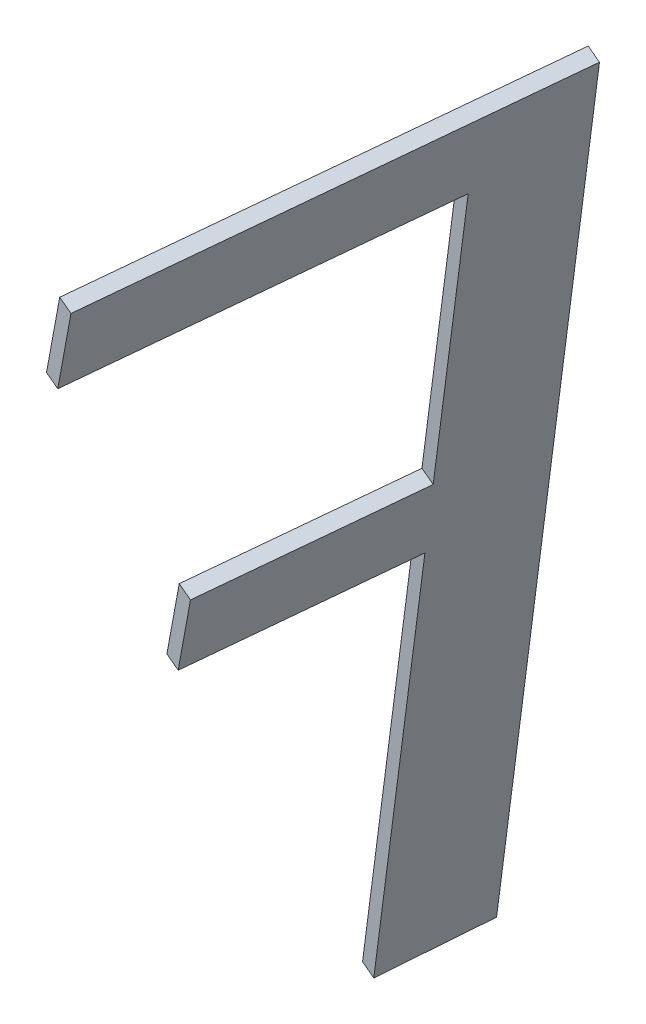
ISO-10303-21;
HEADER;
FILE_DESCRIPTION(('STEP AP214'),'2;1');
FILE_NAME('part.step','',(''),(''),'','','');
FILE_SCHEMA(('AUTOMOTIVE_DESIGN { 1 0 10303 214 1 1 1 1 }'));
ENDSEC;
DATA;
#1=APPLICATION_CONTEXT('core data for automotive mechanical design processes');
#2=APPLICATION_PROTOCOL_DEFINITION('international standard','automotive_design',2000,#1);
#3=PRODUCT_CONTEXT('',#1,'mechanical');
#4=PRODUCT('Part','Part','',(#3));
#5=PRODUCT_RELATED_PRODUCT_CATEGORY('part','',(#4));
#6=PRODUCT_DEFINITION_FORMATION('','',#4);
#7=PRODUCT_DEFINITION_CONTEXT('part definition',#1,'design');
#8=PRODUCT_DEFINITION('design','',#6,#7);
#9=PRODUCT_DEFINITION_SHAPE('','',#8);
#10=(LENGTH_UNIT() NAMED_UNIT(*) SI_UNIT(.MILLI.,.METRE.));
#11=(NAMED_UNIT(*) PLANE_ANGLE_UNIT() SI_UNIT($,.RADIAN.));
#12=(NAMED_UNIT(*) SI_UNIT($,.STERADIAN.) SOLID_ANGLE_UNIT());
#13=UNCERTAINTY_MEASURE_WITH_UNIT(LENGTH_MEASURE(1.E-05),#10,'distance_accuracy_value','');
#14=(GEOMETRIC_REPRESENTATION_CONTEXT(3) GLOBAL_UNCERTAINTY_ASSIGNED_CONTEXT((#13)) GLOBAL_UNIT_ASSIGNED_CONTEXT((#10,
#11,#12)) REPRESENTATION_CONTEXT('',''));
#15=CARTESIAN_POINT('',(0.,0.,0.));
#16=DIRECTION('',(0.,0.,1.));
#17=DIRECTION('',(1.,0.,0.));
#18=AXIS2_PLACEMENT_3D('',#15,#16,#17);
#19=CARTESIAN_POINT('',(-140.081640362419,70.8212531387168,-139.703121267925));
#20=DIRECTION('',(0.251094526540656,0.16569123548096,-0.953676021102616));
#21=DIRECTION('',(0.332083365652077,0.91069878724547,0.245659026227043));
#22=AXIS2_PLACEMENT_3D('',#19,#20,#21);
#23=PLANE('',#22);
#24=DIRECTION('',(-0.909215143405846,0.378383579710355,-0.173648177666983));
#25=VECTOR('',#24,1.);
#26=CARTESIAN_POINT('',(-140.09527858957,70.8269288924125,-139.70572599059));
#27=LINE('',#26,#25);
#28=CARTESIAN_POINT('',(-140.081640362419,70.8212531387168,-139.703121267925));
#29=VERTEX_POINT('',#28);
#30=CARTESIAN_POINT('',(-140.108916816721,70.8326046461081,-139.708330713255));
#31=VERTEX_POINT('',#30);
#32=EDGE_CURVE('E35',#29,#31,#27,.T.);
#33=ORIENTED_EDGE('',*,*,#32,.F.);
#34=DIRECTION('',(-0.332083365652076,-0.91069878724547,-0.245659026227044));
#35=VECTOR('',#34,1.);
#36=CARTESIAN_POINT('',(-140.469601094695,69.7573173776346,-139.990115636066));
#37=LINE('',#36,#35);
#38=CARTESIAN_POINT('',(-140.857561826966,68.6933816165606,-140.277110004211));
#39=VERTEX_POINT('',#38);
#40=EDGE_CURVE('E11',#29,#39,#37,.T.);
#41=ORIENTED_EDGE('',*,*,#40,.T.);
#42=DIRECTION('',(-0.909215143405846,0.378383579710355,-0.173648177666983));
#43=VECTOR('',#42,1.);
#44=CARTESIAN_POINT('',(-140.871200054118,68.6990573702562,-140.279714726876));
#45=LINE('',#44,#43);
#46=CARTESIAN_POINT('',(-140.884838281269,68.7047331239519,-140.282319449541));
#47=VERTEX_POINT('',#46);
#48=EDGE_CURVE('E27',#39,#47,#45,.T.);
#49=ORIENTED_EDGE('',*,*,#48,.T.);
#50=DIRECTION('',(-0.332083365652076,-0.91069878724547,-0.245659026227044));
#51=VECTOR('',#50,1.);
#52=CARTESIAN_POINT('',(-140.496877548997,69.768668885026,-139.995325081396));
#53=LINE('',#52,#51);
#54=EDGE_CURVE('E111',#31,#47,#53,.T.);
#55=ORIENTED_EDGE('',*,*,#54,.F.);
#56=EDGE_LOOP('',(#33,#41,#49,#55));
#57=FACE_BOUND('',#56,.T.);
#58=ADVANCED_FACE('F17',(#57),#23,.T.);
#59=CARTESIAN_POINT('',(-140.857561826966,68.6933816165606,-140.277110004211));
#60=DIRECTION('',(-0.332083365652076,-0.91069878724547,-0.245659026227044));
#61=DIRECTION('',(0.251094526540657,0.165691235480961,-0.953676021102616));
#62=AXIS2_PLACEMENT_3D('',#59,#60,#61);
#63=PLANE('',#62);
#64=ORIENTED_EDGE('',*,*,#48,.F.);
#65=DIRECTION('',(-0.251094526540656,-0.16569123548096,0.953676021102616));
#66=VECTOR('',#65,1.);
#67=CARTESIAN_POINT('',(-140.88267127962,68.6768124929817,-140.18174240217));
#68=LINE('',#67,#66);
#69=CARTESIAN_POINT('',(-140.907780732276,68.6602433694395,-140.086374800035));
#70=VERTEX_POINT('',#69);
#71=EDGE_CURVE('E117',#39,#70,#68,.T.);
#72=ORIENTED_EDGE('',*,*,#71,.T.);
#73=DIRECTION('',(-0.909215143405846,0.378383579710355,-0.173648177666983));
#74=VECTOR('',#73,1.);
#75=CARTESIAN_POINT('',(-140.921418959427,68.6659191231351,-140.0889795227));
#76=LINE('',#75,#74);
#77=CARTESIAN_POINT('',(-140.935057186578,68.6715948768308,-140.091584245365));
#78=VERTEX_POINT('',#77);
#79=EDGE_CURVE('E121',#70,#78,#76,.T.);
#80=ORIENTED_EDGE('',*,*,#79,.T.);
#81=DIRECTION('',(-0.251094526540656,-0.16569123548096,0.953676021102616));
#82=VECTOR('',#81,1.);
#83=CARTESIAN_POINT('',(-140.909947733922,68.688164000373,-140.1869518475));
#84=LINE('',#83,#82);
#85=EDGE_CURVE('E113',#47,#78,#84,.T.);
#86=ORIENTED_EDGE('',*,*,#85,.F.);
#87=EDGE_LOOP('',(#64,#72,#80,#86));
#88=FACE_BOUND('',#87,.T.);
#89=ADVANCED_FACE('F181',(#88),#63,.T.);
#90=CARTESIAN_POINT('',(-140.521979266488,69.7182576012787,-139.800977751528));
#91=DIRECTION('',(0.251094526540656,0.16569123548096,-0.953676021102616));
#92=DIRECTION('',(0.332083365652077,0.91069878724547,0.245659026227043));
#93=AXIS2_PLACEMENT_3D('',#90,#91,#92);
#94=PLANE('',#93);
#95=ORIENTED_EDGE('',*,*,#79,.F.);
#96=DIRECTION('',(0.332083365652076,0.91069878724547,0.245659026227044));
#97=VECTOR('',#96,1.);
#98=CARTESIAN_POINT('',(-140.71487999938,69.1892504853632,-139.943676275784));
#99=LINE('',#98,#97);
#100=CARTESIAN_POINT('',(-140.521979266488,69.7182576012787,-139.800977751528));
#101=VERTEX_POINT('',#100);
#102=EDGE_CURVE('E124',#70,#101,#99,.T.);
#103=ORIENTED_EDGE('',*,*,#102,.T.);
#104=DIRECTION('',(-0.909215143405846,0.378383579710355,-0.173648177666983));
#105=VECTOR('',#104,1.);
#106=CARTESIAN_POINT('',(-140.535617493639,69.7239333549744,-139.803582474193));
#107=LINE('',#106,#105);
#108=CARTESIAN_POINT('',(-140.54925572079,69.7296091086701,-139.806187196858));
#109=VERTEX_POINT('',#108);
#110=EDGE_CURVE('E129',#101,#109,#107,.T.);
#111=ORIENTED_EDGE('',*,*,#110,.T.);
#112=DIRECTION('',(0.332083365652076,0.91069878724547,0.245659026227044));
#113=VECTOR('',#112,1.);
#114=CARTESIAN_POINT('',(-140.742156453682,69.2006019927545,-139.948885721114));
#115=LINE('',#114,#113);
#116=EDGE_CURVE('E126',#78,#109,#115,.T.);
#117=ORIENTED_EDGE('',*,*,#116,.F.);
#118=EDGE_LOOP('',(#95,#103,#111,#117));
#119=FACE_BOUND('',#118,.T.);
#120=ADVANCED_FACE('F185',(#119),#94,.F.);
#121=CARTESIAN_POINT('',(-140.521979266488,69.7182576012787,-139.800977751528));
#122=DIRECTION('',(-0.340871517667753,-0.916053339166555,-0.211312300268316));
#123=DIRECTION('',(0.239028097604382,0.132936625530292,-0.96186975321415));
#124=AXIS2_PLACEMENT_3D('',#121,#122,#123);
#125=PLANE('',#124);
#126=ORIENTED_EDGE('',*,*,#110,.F.);
#127=DIRECTION('',(-0.239028097604382,-0.132936625530292,0.96186975321415));
#128=VECTOR('',#127,1.);
#129=CARTESIAN_POINT('',(-140.570180055047,69.6914505010234,-139.607013606447));
#130=LINE('',#129,#128);
#131=CARTESIAN_POINT('',(-140.618380843612,69.6646434007153,-139.413049461451));
#132=VERTEX_POINT('',#131);
#133=EDGE_CURVE('E132',#101,#132,#130,.T.);
#134=ORIENTED_EDGE('',*,*,#133,.T.);
#135=DIRECTION('',(-0.909215143405846,0.378383579710355,-0.173648177666983));
#136=VECTOR('',#135,1.);
#137=CARTESIAN_POINT('',(-140.632019070764,69.6703191544109,-139.415654184116));
#138=LINE('',#137,#136);
#139=CARTESIAN_POINT('',(-140.645657297915,69.6759949081066,-139.418258906781));
#140=VERTEX_POINT('',#139);
#141=EDGE_CURVE('E137',#132,#140,#138,.T.);
#142=ORIENTED_EDGE('',*,*,#141,.T.);
#143=DIRECTION('',(-0.239028097604382,-0.132936625530292,0.96186975321415));
#144=VECTOR('',#143,1.);
#145=CARTESIAN_POINT('',(-140.597456509349,69.7028020084147,-139.612223051777));
#146=LINE('',#145,#144);
#147=EDGE_CURVE('E134',#109,#140,#146,.T.);
#148=ORIENTED_EDGE('',*,*,#147,.F.);
#149=EDGE_LOOP('',(#126,#134,#142,#148));
#150=FACE_BOUND('',#149,.T.);
#151=ADVANCED_FACE('F188',(#150),#125,.T.);
#152=CARTESIAN_POINT('',(-140.618380843612,69.6646434007153,-139.413049461451));
#153=DIRECTION('',(-0.239028097604382,-0.132936625530292,0.96186975321415));
#154=DIRECTION('',(-0.340871517667753,-0.916053339166555,-0.211312300268316));
#155=AXIS2_PLACEMENT_3D('',#152,#153,#154);
#156=PLANE('',#155);
#157=ORIENTED_EDGE('',*,*,#141,.F.);
#158=DIRECTION('',(0.340871517667753,0.916053339166555,0.211312300268316));
#159=VECTOR('',#158,1.);
#160=CARTESIAN_POINT('',(-140.586541016105,69.7502093069136,-139.393311387597));
#161=LINE('',#160,#159);
#162=CARTESIAN_POINT('',(-140.554701188602,69.8357752131039,-139.37357331374));
#163=VERTEX_POINT('',#162);
#164=EDGE_CURVE('E140',#132,#163,#161,.T.);
#165=ORIENTED_EDGE('',*,*,#164,.T.);
#166=DIRECTION('',(-0.909215143405846,0.378383579710355,-0.173648177666983));
#167=VECTOR('',#166,1.);
#168=CARTESIAN_POINT('',(-140.568339415753,69.8414509667996,-139.376178036405));
#169=LINE('',#168,#167);
#170=CARTESIAN_POINT('',(-140.581977642904,69.8471267204952,-139.37878275907));
#171=VERTEX_POINT('',#170);
#172=EDGE_CURVE('E145',#163,#171,#169,.T.);
#173=ORIENTED_EDGE('',*,*,#172,.T.);
#174=DIRECTION('',(0.340871517667753,0.916053339166555,0.211312300268316));
#175=VECTOR('',#174,1.);
#176=CARTESIAN_POINT('',(-140.613817470407,69.761560814305,-139.398520832927));
#177=LINE('',#176,#175);
#178=EDGE_CURVE('E142',#140,#171,#177,.T.);
#179=ORIENTED_EDGE('',*,*,#178,.F.);
#180=EDGE_LOOP('',(#157,#165,#173,#179));
#181=FACE_BOUND('',#180,.T.);
#182=ADVANCED_FACE('F192',(#181),#156,.T.);
#183=CARTESIAN_POINT('',(-140.554701188602,69.8357752131039,-139.37357331374));
#184=DIRECTION('',(0.340871517667753,0.916053339166555,0.211312300268316));
#185=DIRECTION('',(-0.239028097604382,-0.132936625530292,0.96186975321415));
#186=AXIS2_PLACEMENT_3D('',#183,#184,#185);
#187=PLANE('',#186);
#188=ORIENTED_EDGE('',*,*,#172,.F.);
#189=DIRECTION('',(0.239028097604382,0.132936625530292,-0.96186975321415));
#190=VECTOR('',#189,1.);
#191=CARTESIAN_POINT('',(-140.507301324216,69.862136875557,-139.564314470564));
#192=LINE('',#191,#190);
#193=CARTESIAN_POINT('',(-140.459901459827,69.8884985380182,-139.755055627392));
#194=VERTEX_POINT('',#193);
#195=EDGE_CURVE('E148',#163,#194,#192,.T.);
#196=ORIENTED_EDGE('',*,*,#195,.T.);
#197=DIRECTION('',(-0.909215143405846,0.378383579710355,-0.173648177666983));
#198=VECTOR('',#197,1.);
#199=CARTESIAN_POINT('',(-140.473539686978,69.8941742917139,-139.757660350057));
#200=LINE('',#199,#198);
#201=CARTESIAN_POINT('',(-140.487177914129,69.8998500454095,-139.760265072722));
#202=VERTEX_POINT('',#201);
#203=EDGE_CURVE('E153',#194,#202,#200,.T.);
#204=ORIENTED_EDGE('',*,*,#203,.T.);
#205=DIRECTION('',(0.239028097604382,0.132936625530292,-0.96186975321415));
#206=VECTOR('',#205,1.);
#207=CARTESIAN_POINT('',(-140.534577778518,69.8734883829483,-139.569523915894));
#208=LINE('',#207,#206);
#209=EDGE_CURVE('E150',#171,#202,#208,.T.);
#210=ORIENTED_EDGE('',*,*,#209,.F.);
#211=EDGE_LOOP('',(#188,#196,#204,#210));
#212=FACE_BOUND('',#211,.T.);
#213=ADVANCED_FACE('F196',(#212),#187,.T.);
#214=CARTESIAN_POINT('',(-140.521979266488,69.7182576012787,-139.800977751528));
#215=DIRECTION('',(0.251094526540656,0.16569123548096,-0.953676021102616));
#216=DIRECTION('',(0.332083365652077,0.91069878724547,0.245659026227043));
#217=AXIS2_PLACEMENT_3D('',#214,#215,#216);
#218=PLANE('',#217);
#219=ORIENTED_EDGE('',*,*,#203,.F.);
#220=DIRECTION('',(0.332083365652076,0.91069878724547,0.245659026227044));
#221=VECTOR('',#220,1.);
#222=CARTESIAN_POINT('',(-140.327918792119,70.2504451690299,-139.657421307312));
#223=LINE('',#222,#221);
#224=CARTESIAN_POINT('',(-140.195936124411,70.6123918000425,-139.559786987233));
#225=VERTEX_POINT('',#224);
#226=EDGE_CURVE('E156',#194,#225,#223,.T.);
#227=ORIENTED_EDGE('',*,*,#226,.T.);
#228=DIRECTION('',(-0.909215143405846,0.378383579710355,-0.173648177666983));
#229=VECTOR('',#228,1.);
#230=CARTESIAN_POINT('',(-140.209574351562,70.6180675537381,-139.562391709898));
#231=LINE('',#230,#229);
#232=CARTESIAN_POINT('',(-140.223212578713,70.6237433074338,-139.564996432563));
#233=VERTEX_POINT('',#232);
#234=EDGE_CURVE('E161',#225,#233,#231,.T.);
#235=ORIENTED_EDGE('',*,*,#234,.T.);
#236=DIRECTION('',(0.332083365652076,0.91069878724547,0.245659026227044));
#237=VECTOR('',#236,1.);
#238=CARTESIAN_POINT('',(-140.355195246421,70.2617966764212,-139.662630752642));
#239=LINE('',#238,#237);
#240=EDGE_CURVE('E158',#202,#233,#239,.T.);
#241=ORIENTED_EDGE('',*,*,#240,.F.);
#242=EDGE_LOOP('',(#219,#227,#235,#241));
#243=FACE_BOUND('',#242,.T.);
#244=ADVANCED_FACE('F199',(#243),#218,.F.);
#245=CARTESIAN_POINT('',(-140.195936124411,70.6123918000425,-139.559786987233));
#246=DIRECTION('',(-0.340871517667753,-0.916053339166555,-0.211312300268316));
#247=DIRECTION('',(0.239028097604382,0.132936625530292,-0.96186975321415));
#248=AXIS2_PLACEMENT_3D('',#245,#246,#247);
#249=PLANE('',#248);
#250=ORIENTED_EDGE('',*,*,#234,.F.);
#251=DIRECTION('',(-0.239028097604382,-0.132936625530292,0.96186975321415));
#252=VECTOR('',#251,1.);
#253=CARTESIAN_POINT('',(-140.276090447339,70.5678135880375,-139.237239054208));
#254=LINE('',#253,#252);
#255=CARTESIAN_POINT('',(-140.356244770269,70.5232353760285,-138.914691121181));
#256=VERTEX_POINT('',#255);
#257=EDGE_CURVE('E164',#225,#256,#254,.T.);
#258=ORIENTED_EDGE('',*,*,#257,.T.);
#259=DIRECTION('',(-0.909215143405846,0.378383579710355,-0.173648177666983));
#260=VECTOR('',#259,1.);
#261=CARTESIAN_POINT('',(-140.36988299742,70.5289111297241,-138.917295843846));
#262=LINE('',#261,#260);
#263=CARTESIAN_POINT('',(-140.383521224571,70.5345868834198,-138.919900566511));
#264=VERTEX_POINT('',#263);
#265=EDGE_CURVE('E168',#256,#264,#262,.T.);
#266=ORIENTED_EDGE('',*,*,#265,.T.);
#267=DIRECTION('',(-0.239028097604382,-0.132936625530292,0.96186975321415));
#268=VECTOR('',#267,1.);
#269=CARTESIAN_POINT('',(-140.303366901641,70.5791650954288,-139.242448499538));
#270=LINE('',#269,#268);
#271=EDGE_CURVE('E100',#233,#264,#270,.T.);
#272=ORIENTED_EDGE('',*,*,#271,.F.);
#273=EDGE_LOOP('',(#250,#258,#266,#272));
#274=FACE_BOUND('',#273,.T.);
#275=ADVANCED_FACE('F172',(#274),#249,.T.);
#276=CARTESIAN_POINT('',(-140.288070466734,70.7064460438524,-138.872428661155));
#277=DIRECTION('',(0.239028097604382,0.132936625530292,-0.96186975321415));
#278=DIRECTION('',(0.340871517667753,0.916053339166555,0.211312300268316));
#279=AXIS2_PLACEMENT_3D('',#276,#277,#278);
#280=PLANE('',#279);
#281=ORIENTED_EDGE('',*,*,#265,.F.);
#282=DIRECTION('',(0.340871517667753,0.916053339166555,0.211312300268316));
#283=VECTOR('',#282,1.);
#284=CARTESIAN_POINT('',(-140.322157618501,70.6148407099428,-138.893559891169));
#285=LINE('',#284,#283);
#286=CARTESIAN_POINT('',(-140.288070466734,70.7064460438524,-138.872428661155));
#287=VERTEX_POINT('',#286);
#288=EDGE_CURVE('E106',#256,#287,#285,.T.);
#289=ORIENTED_EDGE('',*,*,#288,.T.);
#290=DIRECTION('',(-0.909215143405846,0.378383579710355,-0.173648177666983));
#291=VECTOR('',#290,1.);
#292=CARTESIAN_POINT('',(-140.301708693885,70.712121797548,-138.87503338382));
#293=LINE('',#292,#291);
#294=CARTESIAN_POINT('',(-140.315346921036,70.7177975512437,-138.877638106485));
#295=VERTEX_POINT('',#294);
#296=EDGE_CURVE('E92',#287,#295,#293,.T.);
#297=ORIENTED_EDGE('',*,*,#296,.T.);
#298=DIRECTION('',(0.340871517667753,0.916053339166555,0.211312300268316));
#299=VECTOR('',#298,1.);
#300=CARTESIAN_POINT('',(-140.349434072803,70.6261922173341,-138.898769336499));
#301=LINE('',#300,#299);
#302=EDGE_CURVE('E98',#264,#295,#301,.T.);
#303=ORIENTED_EDGE('',*,*,#302,.F.);
#304=EDGE_LOOP('',(#281,#289,#297,#303));
#305=FACE_BOUND('',#304,.T.);
#306=ADVANCED_FACE('F104',(#305),#280,.F.);
#307=CARTESIAN_POINT('',(-140.081640362419,70.8212531387168,-139.703121267925));
#308=DIRECTION('',(-0.340871517667753,-0.916053339166555,-0.211312300268316));
#309=DIRECTION('',(0.239028097604382,0.132936625530292,-0.96186975321415));
#310=AXIS2_PLACEMENT_3D('',#307,#308,#309);
#311=PLANE('',#310);
#312=ORIENTED_EDGE('',*,*,#296,.F.);
#313=DIRECTION('',(0.239028097604382,0.132936625530292,-0.96186975321415));
#314=VECTOR('',#313,1.);
#315=CARTESIAN_POINT('',(-140.184855414577,70.7638495912846,-139.28777496454));
#316=LINE('',#315,#314);
#317=EDGE_CURVE('E108',#287,#29,#316,.T.);
#318=ORIENTED_EDGE('',*,*,#317,.T.);
#319=ORIENTED_EDGE('',*,*,#32,.T.);
#320=DIRECTION('',(0.239028097604382,0.132936625530292,-0.96186975321415));
#321=VECTOR('',#320,1.);
#322=CARTESIAN_POINT('',(-140.212131868879,70.7752010986759,-139.29298440987));
#323=LINE('',#322,#321);
#324=EDGE_CURVE('E21',#295,#31,#323,.T.);
#325=ORIENTED_EDGE('',*,*,#324,.F.);
#326=EDGE_LOOP('',(#312,#318,#319,#325));
#327=FACE_BOUND('',#326,.T.);
#328=ADVANCED_FACE('F110',(#327),#311,.F.);
#329=CARTESIAN_POINT('',(-140.197105636582,63.1845344254721,-155.739144366844));
#330=DIRECTION('',(-0.909215143405846,0.378383579710355,-0.173648177666983));
#331=DIRECTION('',(-0.015180111181639,-0.4469491584612,-0.894430552908015));
#332=AXIS2_PLACEMENT_3D('',#329,#330,#331);
#333=PLANE('',#332);
#334=ORIENTED_EDGE('',*,*,#317,.F.);
#335=ORIENTED_EDGE('',*,*,#288,.F.);
#336=ORIENTED_EDGE('',*,*,#257,.F.);
#337=ORIENTED_EDGE('',*,*,#226,.F.);
#338=ORIENTED_EDGE('',*,*,#195,.F.);
#339=ORIENTED_EDGE('',*,*,#164,.F.);
#340=ORIENTED_EDGE('',*,*,#133,.F.);
#341=ORIENTED_EDGE('',*,*,#102,.F.);
#342=ORIENTED_EDGE('',*,*,#71,.F.);
#343=ORIENTED_EDGE('',*,*,#40,.F.);
#344=EDGE_LOOP('',(#334,#335,#336,#337,#338,#339,#340,#341,#342,#343));
#345=FACE_BOUND('',#344,.T.);
#346=ADVANCED_FACE('F176',(#345),#333,.F.);
#347=CARTESIAN_POINT('',(-140.224382090884,63.1958859328634,-155.744353812174));
#348=DIRECTION('',(-0.909215143405846,0.378383579710355,-0.173648177666983));
#349=DIRECTION('',(-0.015180111181639,-0.4469491584612,-0.894430552908015));
#350=AXIS2_PLACEMENT_3D('',#347,#348,#349);
#351=PLANE('',#350);
#352=ORIENTED_EDGE('',*,*,#54,.T.);
#353=ORIENTED_EDGE('',*,*,#85,.T.);
#354=ORIENTED_EDGE('',*,*,#116,.T.);
#355=ORIENTED_EDGE('',*,*,#147,.T.);
#356=ORIENTED_EDGE('',*,*,#178,.T.);
#357=ORIENTED_EDGE('',*,*,#209,.T.);
#358=ORIENTED_EDGE('',*,*,#240,.T.);
#359=ORIENTED_EDGE('',*,*,#271,.T.);
#360=ORIENTED_EDGE('',*,*,#302,.T.);
#361=ORIENTED_EDGE('',*,*,#324,.T.);
#362=EDGE_LOOP('',(#352,#353,#354,#355,#356,#357,#358,#359,#360,#361));
#363=FACE_BOUND('',#362,.T.);
#364=ADVANCED_FACE('F19',(#363),#351,.T.);
#365=CLOSED_SHELL('',(#58,#89,#120,#151,#182,#213,#244,#275,#306,#328,#346,#364));
#366=MANIFOLD_SOLID_BREP('B1',#365);
#367=ADVANCED_BREP_SHAPE_REPRESENTATION('',(#18,#366),#14);
#368=SHAPE_DEFINITION_REPRESENTATION(#9,#367);
ENDSEC;
END-ISO-10303-21;
